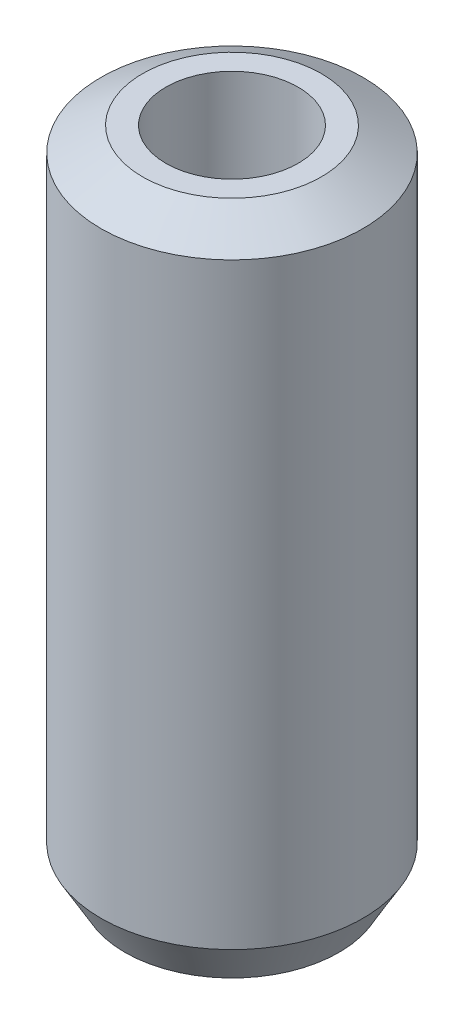
ISO-10303-21;
HEADER;
FILE_DESCRIPTION(('STEP AP214'),'2;1');
FILE_NAME('part.step','',(''),(''),'','','');
FILE_SCHEMA(('AUTOMOTIVE_DESIGN { 1 0 10303 214 1 1 1 1 }'));
ENDSEC;
DATA;
#1=APPLICATION_CONTEXT('core data for automotive mechanical design processes');
#2=APPLICATION_PROTOCOL_DEFINITION('international standard','automotive_design',2000,#1);
#3=PRODUCT_CONTEXT('',#1,'mechanical');
#4=PRODUCT('Part','Part','',(#3));
#5=PRODUCT_RELATED_PRODUCT_CATEGORY('part','',(#4));
#6=PRODUCT_DEFINITION_FORMATION('','',#4);
#7=PRODUCT_DEFINITION_CONTEXT('part definition',#1,'design');
#8=PRODUCT_DEFINITION('design','',#6,#7);
#9=PRODUCT_DEFINITION_SHAPE('','',#8);
#10=(LENGTH_UNIT() NAMED_UNIT(*) SI_UNIT(.MILLI.,.METRE.));
#11=(NAMED_UNIT(*) PLANE_ANGLE_UNIT() SI_UNIT($,.RADIAN.));
#12=(NAMED_UNIT(*) SI_UNIT($,.STERADIAN.) SOLID_ANGLE_UNIT());
#13=UNCERTAINTY_MEASURE_WITH_UNIT(LENGTH_MEASURE(1.E-05),#10,'distance_accuracy_value','');
#14=(GEOMETRIC_REPRESENTATION_CONTEXT(3) GLOBAL_UNCERTAINTY_ASSIGNED_CONTEXT((#13)) GLOBAL_UNIT_ASSIGNED_CONTEXT((#10,
#11,#12)) REPRESENTATION_CONTEXT('',''));
#15=CARTESIAN_POINT('',(0.,0.,0.));
#16=DIRECTION('',(0.,0.,1.));
#17=DIRECTION('',(1.,0.,0.));
#18=AXIS2_PLACEMENT_3D('',#15,#16,#17);
#19=CARTESIAN_POINT('',(0.,151.770530501543,0.));
#20=DIRECTION('',(0.,-1.,0.));
#21=DIRECTION('',(0.,0.,-1.));
#22=AXIS2_PLACEMENT_3D('',#19,#20,#21);
#23=CYLINDRICAL_SURFACE('',#22,30.);
#24=CARTESIAN_POINT('',(0.,146.274340981266,0.));
#25=DIRECTION('',(0.,1.,0.));
#26=DIRECTION('',(0.,0.,1.));
#27=AXIS2_PLACEMENT_3D('',#24,#25,#26);
#28=CIRCLE('',#27,30.);
#29=CARTESIAN_POINT('',(0.,146.274340981266,30.));
#30=VERTEX_POINT('',#29);
#31=EDGE_CURVE('E50',#30,#30,#28,.F.);
#32=ORIENTED_EDGE('',*,*,#31,.T.);
#33=EDGE_LOOP('',(#32));
#34=FACE_BOUND('',#33,.T.);
#35=CARTESIAN_POINT('',(0.,9.51967949714594,0.));
#36=DIRECTION('',(0.,1.,0.));
#37=DIRECTION('',(0.,0.,1.));
#38=AXIS2_PLACEMENT_3D('',#35,#36,#37);
#39=CIRCLE('',#38,30.);
#40=CARTESIAN_POINT('',(0.,9.51967949714594,30.));
#41=VERTEX_POINT('',#40);
#42=EDGE_CURVE('E51',#41,#41,#39,.T.);
#43=ORIENTED_EDGE('',*,*,#42,.T.);
#44=EDGE_LOOP('',(#43));
#45=FACE_BOUND('',#44,.T.);
#46=ADVANCED_FACE('F39',(#34,#45),#23,.T.);
#47=CARTESIAN_POINT('',(0.,151.770530501543,0.));
#48=DIRECTION('',(0.,1.,0.));
#49=DIRECTION('',(0.,0.,1.));
#50=AXIS2_PLACEMENT_3D('',#47,#48,#49);
#51=PLANE('',#50);
#52=CARTESIAN_POINT('',(0.,151.770530501543,0.));
#53=DIRECTION('',(0.,1.,0.));
#54=DIRECTION('',(0.,0.,1.));
#55=AXIS2_PLACEMENT_3D('',#52,#53,#54);
#56=CIRCLE('',#55,20.4803205028541);
#57=CARTESIAN_POINT('',(0.,151.770530501543,20.4803205028541));
#58=VERTEX_POINT('',#57);
#59=EDGE_CURVE('E54',#58,#58,#56,.T.);
#60=ORIENTED_EDGE('',*,*,#59,.T.);
#61=EDGE_LOOP('',(#60));
#62=FACE_BOUND('',#61,.T.);
#63=CARTESIAN_POINT('',(0.,151.770530501543,0.));
#64=DIRECTION('',(0.,1.,0.));
#65=DIRECTION('',(0.,0.,1.));
#66=AXIS2_PLACEMENT_3D('',#63,#64,#65);
#67=CIRCLE('',#66,15.1395684219751);
#68=CARTESIAN_POINT('',(0.,151.770530501543,15.1395684219751));
#69=VERTEX_POINT('',#68);
#70=EDGE_CURVE('E58',#69,#69,#67,.T.);
#71=ORIENTED_EDGE('',*,*,#70,.F.);
#72=EDGE_LOOP('',(#71));
#73=FACE_BOUND('',#72,.T.);
#74=ADVANCED_FACE('F69',(#62,#73),#51,.T.);
#75=CARTESIAN_POINT('',(0.,0.,0.));
#76=DIRECTION('',(0.,1.,0.));
#77=DIRECTION('',(0.,0.,1.));
#78=AXIS2_PLACEMENT_3D('',#75,#76,#77);
#79=PLANE('',#78);
#80=CARTESIAN_POINT('',(0.,0.,0.));
#81=DIRECTION('',(0.,1.,0.));
#82=DIRECTION('',(0.,0.,1.));
#83=AXIS2_PLACEMENT_3D('',#80,#81,#82);
#84=CIRCLE('',#83,24.5038104797238);
#85=CARTESIAN_POINT('',(0.,0.,24.5038104797238));
#86=VERTEX_POINT('',#85);
#87=EDGE_CURVE('E10',#86,#86,#84,.F.);
#88=ORIENTED_EDGE('',*,*,#87,.T.);
#89=EDGE_LOOP('',(#88));
#90=FACE_BOUND('',#89,.T.);
#91=CARTESIAN_POINT('',(0.,0.,0.));
#92=DIRECTION('',(0.,1.,0.));
#93=DIRECTION('',(0.,0.,1.));
#94=AXIS2_PLACEMENT_3D('',#91,#92,#93);
#95=CIRCLE('',#94,15.1395684219751);
#96=CARTESIAN_POINT('',(0.,0.,15.1395684219751));
#97=VERTEX_POINT('',#96);
#98=EDGE_CURVE('E63',#97,#97,#95,.T.);
#99=ORIENTED_EDGE('',*,*,#98,.T.);
#100=EDGE_LOOP('',(#99));
#101=FACE_BOUND('',#100,.T.);
#102=ADVANCED_FACE('F75',(#90,#101),#79,.F.);
#103=CARTESIAN_POINT('',(0.,151.770530501543,0.));
#104=DIRECTION('',(0.,-1.,0.));
#105=DIRECTION('',(0.,0.,-1.));
#106=AXIS2_PLACEMENT_3D('',#103,#104,#105);
#107=CYLINDRICAL_SURFACE('',#106,15.1395684219751);
#108=ORIENTED_EDGE('',*,*,#70,.T.);
#109=EDGE_LOOP('',(#108));
#110=FACE_BOUND('',#109,.T.);
#111=ORIENTED_EDGE('',*,*,#98,.F.);
#112=EDGE_LOOP('',(#111));
#113=FACE_BOUND('',#112,.T.);
#114=ADVANCED_FACE('F70',(#110,#113),#107,.F.);
#115=CARTESIAN_POINT('',(0.,151.770530501543,0.));
#116=DIRECTION('',(0.,-1.,0.));
#117=DIRECTION('',(0.,0.,-1.));
#118=AXIS2_PLACEMENT_3D('',#115,#116,#117);
#119=CONICAL_SURFACE('',#118,20.4803205028541,1.04719755119659);
#120=ORIENTED_EDGE('',*,*,#31,.F.);
#121=EDGE_LOOP('',(#120));
#122=FACE_BOUND('',#121,.T.);
#123=ORIENTED_EDGE('',*,*,#59,.F.);
#124=EDGE_LOOP('',(#123));
#125=FACE_BOUND('',#124,.T.);
#126=ADVANCED_FACE('F81',(#122,#125),#119,.T.);
#127=CARTESIAN_POINT('',(0.,9.51967949714594,0.));
#128=DIRECTION('',(0.,1.,0.));
#129=DIRECTION('',(0.,0.,1.));
#130=AXIS2_PLACEMENT_3D('',#127,#128,#129);
#131=CONICAL_SURFACE('',#130,30.,0.523598775598303);
#132=ORIENTED_EDGE('',*,*,#87,.F.);
#133=EDGE_LOOP('',(#132));
#134=FACE_BOUND('',#133,.T.);
#135=ORIENTED_EDGE('',*,*,#42,.F.);
#136=EDGE_LOOP('',(#135));
#137=FACE_BOUND('',#136,.T.);
#138=ADVANCED_FACE('F45',(#134,#137),#131,.T.);
#139=CLOSED_SHELL('',(#46,#74,#102,#114,#126,#138));
#140=MANIFOLD_SOLID_BREP('B2',#139);
#141=ADVANCED_BREP_SHAPE_REPRESENTATION('',(#18,#140),#14);
#142=SHAPE_DEFINITION_REPRESENTATION(#9,#141);
ENDSEC;
END-ISO-10303-21;
